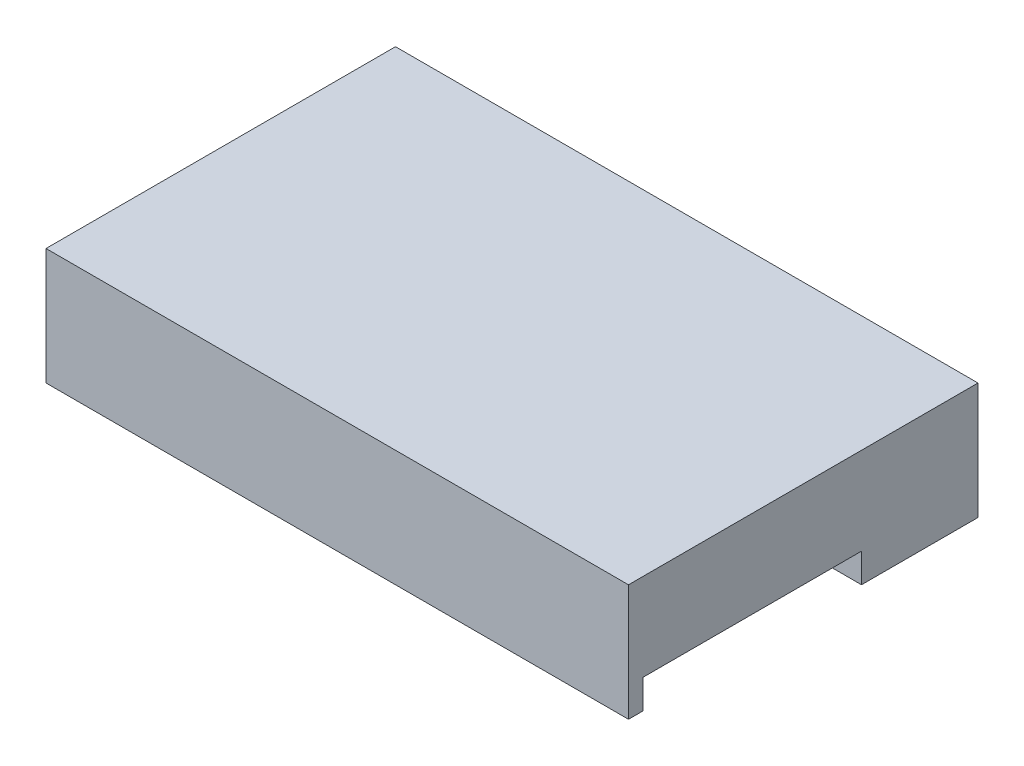
ISO-10303-21;
HEADER;
FILE_DESCRIPTION(('STEP AP214'),'2;1');
FILE_NAME('part.step','',(''),(''),'','','');
FILE_SCHEMA(('AUTOMOTIVE_DESIGN { 1 0 10303 214 1 1 1 1 }'));
ENDSEC;
DATA;
#1=APPLICATION_CONTEXT('core data for automotive mechanical design processes');
#2=APPLICATION_PROTOCOL_DEFINITION('international standard','automotive_design',2000,#1);
#3=PRODUCT_CONTEXT('',#1,'mechanical');
#4=PRODUCT('Part','Part','',(#3));
#5=PRODUCT_RELATED_PRODUCT_CATEGORY('part','',(#4));
#6=PRODUCT_DEFINITION_FORMATION('','',#4);
#7=PRODUCT_DEFINITION_CONTEXT('part definition',#1,'design');
#8=PRODUCT_DEFINITION('design','',#6,#7);
#9=PRODUCT_DEFINITION_SHAPE('','',#8);
#10=(LENGTH_UNIT() NAMED_UNIT(*) SI_UNIT(.MILLI.,.METRE.));
#11=(NAMED_UNIT(*) PLANE_ANGLE_UNIT() SI_UNIT($,.RADIAN.));
#12=(NAMED_UNIT(*) SI_UNIT($,.STERADIAN.) SOLID_ANGLE_UNIT());
#13=UNCERTAINTY_MEASURE_WITH_UNIT(LENGTH_MEASURE(1.E-05),#10,'distance_accuracy_value','');
#14=(GEOMETRIC_REPRESENTATION_CONTEXT(3) GLOBAL_UNCERTAINTY_ASSIGNED_CONTEXT((#13)) GLOBAL_UNIT_ASSIGNED_CONTEXT((#10,
#11,#12)) REPRESENTATION_CONTEXT('',''));
#15=CARTESIAN_POINT('',(0.,0.,0.));
#16=DIRECTION('',(0.,0.,1.));
#17=DIRECTION('',(1.,0.,0.));
#18=AXIS2_PLACEMENT_3D('',#15,#16,#17);
#19=CARTESIAN_POINT('',(0.,1.,0.));
#20=DIRECTION('',(0.,-1.,0.));
#21=DIRECTION('',(0.,0.,-1.));
#22=AXIS2_PLACEMENT_3D('',#19,#20,#21);
#23=PLANE('',#22);
#24=DIRECTION('',(0.,0.,1.));
#25=VECTOR('',#24,1.);
#26=CARTESIAN_POINT('',(10.,1.,6.));
#27=LINE('',#26,#25);
#28=CARTESIAN_POINT('',(10.,1.,-2.));
#29=VERTEX_POINT('',#28);
#30=CARTESIAN_POINT('',(10.,1.,5.5));
#31=VERTEX_POINT('',#30);
#32=EDGE_CURVE('E48',#29,#31,#27,.T.);
#33=ORIENTED_EDGE('',*,*,#32,.T.);
#34=DIRECTION('',(1.,0.,0.));
#35=VECTOR('',#34,1.);
#36=CARTESIAN_POINT('',(-10.,1.,5.5));
#37=LINE('',#36,#35);
#38=CARTESIAN_POINT('',(-10.,1.,5.5));
#39=VERTEX_POINT('',#38);
#40=EDGE_CURVE('E52',#39,#31,#37,.T.);
#41=ORIENTED_EDGE('',*,*,#40,.F.);
#42=DIRECTION('',(0.,0.,-1.));
#43=VECTOR('',#42,1.);
#44=CARTESIAN_POINT('',(-10.,1.,6.));
#45=LINE('',#44,#43);
#46=CARTESIAN_POINT('',(-10.,1.,-2.));
#47=VERTEX_POINT('',#46);
#48=EDGE_CURVE('E121',#39,#47,#45,.T.);
#49=ORIENTED_EDGE('',*,*,#48,.T.);
#50=DIRECTION('',(1.,0.,0.));
#51=VECTOR('',#50,1.);
#52=CARTESIAN_POINT('',(-10.,1.,-2.));
#53=LINE('',#52,#51);
#54=EDGE_CURVE('E129',#47,#29,#53,.T.);
#55=ORIENTED_EDGE('',*,*,#54,.T.);
#56=EDGE_LOOP('',(#33,#41,#49,#55));
#57=FACE_BOUND('',#56,.T.);
#58=ADVANCED_FACE('F33',(#57),#23,.T.);
#59=CARTESIAN_POINT('',(-10.,4.,6.));
#60=DIRECTION('',(0.,0.,-1.));
#61=DIRECTION('',(-1.,0.,0.));
#62=AXIS2_PLACEMENT_3D('',#59,#60,#61);
#63=PLANE('',#62);
#64=DIRECTION('',(0.,-1.,0.));
#65=VECTOR('',#64,1.);
#66=CARTESIAN_POINT('',(-10.,4.,6.));
#67=LINE('',#66,#65);
#68=CARTESIAN_POINT('',(-10.,4.,6.));
#69=VERTEX_POINT('',#68);
#70=CARTESIAN_POINT('',(-10.,0.,6.));
#71=VERTEX_POINT('',#70);
#72=EDGE_CURVE('E154',#69,#71,#67,.T.);
#73=ORIENTED_EDGE('',*,*,#72,.T.);
#74=DIRECTION('',(-1.,0.,0.));
#75=VECTOR('',#74,1.);
#76=CARTESIAN_POINT('',(-10.,0.,6.));
#77=LINE('',#76,#75);
#78=CARTESIAN_POINT('',(10.,0.,6.));
#79=VERTEX_POINT('',#78);
#80=EDGE_CURVE('E114',#79,#71,#77,.T.);
#81=ORIENTED_EDGE('',*,*,#80,.F.);
#82=DIRECTION('',(0.,-1.,0.));
#83=VECTOR('',#82,1.);
#84=CARTESIAN_POINT('',(10.,4.,6.));
#85=LINE('',#84,#83);
#86=CARTESIAN_POINT('',(10.,4.,6.));
#87=VERTEX_POINT('',#86);
#88=EDGE_CURVE('E148',#87,#79,#85,.T.);
#89=ORIENTED_EDGE('',*,*,#88,.F.);
#90=DIRECTION('',(1.,0.,0.));
#91=VECTOR('',#90,1.);
#92=CARTESIAN_POINT('',(-10.,4.,6.));
#93=LINE('',#92,#91);
#94=EDGE_CURVE('E146',#69,#87,#93,.T.);
#95=ORIENTED_EDGE('',*,*,#94,.F.);
#96=EDGE_LOOP('',(#73,#81,#89,#95));
#97=FACE_BOUND('',#96,.T.);
#98=ADVANCED_FACE('F175',(#97),#63,.F.);
#99=CARTESIAN_POINT('',(10.,4.,6.));
#100=DIRECTION('',(-1.,0.,0.));
#101=DIRECTION('',(0.,0.,1.));
#102=AXIS2_PLACEMENT_3D('',#99,#100,#101);
#103=PLANE('',#102);
#104=ORIENTED_EDGE('',*,*,#32,.F.);
#105=DIRECTION('',(0.,-1.,0.));
#106=VECTOR('',#105,1.);
#107=CARTESIAN_POINT('',(10.,1.,-2.));
#108=LINE('',#107,#106);
#109=CARTESIAN_POINT('',(10.,0.,-2.));
#110=VERTEX_POINT('',#109);
#111=EDGE_CURVE('E133',#29,#110,#108,.T.);
#112=ORIENTED_EDGE('',*,*,#111,.T.);
#113=DIRECTION('',(0.,0.,-1.));
#114=VECTOR('',#113,1.);
#115=CARTESIAN_POINT('',(10.,0.,6.));
#116=LINE('',#115,#114);
#117=CARTESIAN_POINT('',(10.,0.,-6.));
#118=VERTEX_POINT('',#117);
#119=EDGE_CURVE('E136',#110,#118,#116,.T.);
#120=ORIENTED_EDGE('',*,*,#119,.T.);
#121=DIRECTION('',(0.,-1.,0.));
#122=VECTOR('',#121,1.);
#123=CARTESIAN_POINT('',(10.,4.,-6.));
#124=LINE('',#123,#122);
#125=CARTESIAN_POINT('',(10.,4.,-6.));
#126=VERTEX_POINT('',#125);
#127=EDGE_CURVE('E11',#126,#118,#124,.T.);
#128=ORIENTED_EDGE('',*,*,#127,.F.);
#129=DIRECTION('',(0.,0.,-1.));
#130=VECTOR('',#129,1.);
#131=CARTESIAN_POINT('',(10.,4.,6.));
#132=LINE('',#131,#130);
#133=EDGE_CURVE('E138',#87,#126,#132,.T.);
#134=ORIENTED_EDGE('',*,*,#133,.F.);
#135=ORIENTED_EDGE('',*,*,#88,.T.);
#136=DIRECTION('',(0.,0.,1.));
#137=VECTOR('',#136,1.);
#138=CARTESIAN_POINT('',(10.,0.,6.));
#139=LINE('',#138,#137);
#140=CARTESIAN_POINT('',(10.,0.,5.5));
#141=VERTEX_POINT('',#140);
#142=EDGE_CURVE('E107',#141,#79,#139,.T.);
#143=ORIENTED_EDGE('',*,*,#142,.F.);
#144=DIRECTION('',(0.,1.,0.));
#145=VECTOR('',#144,1.);
#146=CARTESIAN_POINT('',(10.,0.,5.5));
#147=LINE('',#146,#145);
#148=EDGE_CURVE('E103',#141,#31,#147,.T.);
#149=ORIENTED_EDGE('',*,*,#148,.T.);
#150=EDGE_LOOP('',(#104,#112,#120,#128,#134,#135,#143,#149));
#151=FACE_BOUND('',#150,.T.);
#152=ADVANCED_FACE('F35',(#151),#103,.F.);
#153=CARTESIAN_POINT('',(-10.,4.,-6.));
#154=DIRECTION('',(0.,0.,1.));
#155=DIRECTION('',(1.,0.,0.));
#156=AXIS2_PLACEMENT_3D('',#153,#154,#155);
#157=PLANE('',#156);
#158=DIRECTION('',(-1.,0.,0.));
#159=VECTOR('',#158,1.);
#160=CARTESIAN_POINT('',(-10.,0.,-6.));
#161=LINE('',#160,#159);
#162=CARTESIAN_POINT('',(-10.,0.,-6.));
#163=VERTEX_POINT('',#162);
#164=EDGE_CURVE('E150',#118,#163,#161,.T.);
#165=ORIENTED_EDGE('',*,*,#164,.T.);
#166=DIRECTION('',(0.,-1.,0.));
#167=VECTOR('',#166,1.);
#168=CARTESIAN_POINT('',(-10.,4.,-6.));
#169=LINE('',#168,#167);
#170=CARTESIAN_POINT('',(-10.,4.,-6.));
#171=VERTEX_POINT('',#170);
#172=EDGE_CURVE('E41',#171,#163,#169,.T.);
#173=ORIENTED_EDGE('',*,*,#172,.F.);
#174=DIRECTION('',(-1.,0.,0.));
#175=VECTOR('',#174,1.);
#176=CARTESIAN_POINT('',(-10.,4.,-6.));
#177=LINE('',#176,#175);
#178=EDGE_CURVE('E141',#126,#171,#177,.T.);
#179=ORIENTED_EDGE('',*,*,#178,.F.);
#180=ORIENTED_EDGE('',*,*,#127,.T.);
#181=EDGE_LOOP('',(#165,#173,#179,#180));
#182=FACE_BOUND('',#181,.T.);
#183=ADVANCED_FACE('F179',(#182),#157,.F.);
#184=CARTESIAN_POINT('',(-10.,4.,6.));
#185=DIRECTION('',(1.,0.,0.));
#186=DIRECTION('',(0.,0.,-1.));
#187=AXIS2_PLACEMENT_3D('',#184,#185,#186);
#188=PLANE('',#187);
#189=DIRECTION('',(0.,0.,1.));
#190=VECTOR('',#189,1.);
#191=CARTESIAN_POINT('',(-10.,0.,6.));
#192=LINE('',#191,#190);
#193=CARTESIAN_POINT('',(-10.,0.,-2.));
#194=VERTEX_POINT('',#193);
#195=EDGE_CURVE('E142',#163,#194,#192,.T.);
#196=ORIENTED_EDGE('',*,*,#195,.T.);
#197=DIRECTION('',(0.,-1.,0.));
#198=VECTOR('',#197,1.);
#199=CARTESIAN_POINT('',(-10.,1.,-2.));
#200=LINE('',#199,#198);
#201=EDGE_CURVE('E131',#47,#194,#200,.T.);
#202=ORIENTED_EDGE('',*,*,#201,.F.);
#203=ORIENTED_EDGE('',*,*,#48,.F.);
#204=DIRECTION('',(0.,1.,0.));
#205=VECTOR('',#204,1.);
#206=CARTESIAN_POINT('',(-10.,0.,5.5));
#207=LINE('',#206,#205);
#208=CARTESIAN_POINT('',(-10.,0.,5.5));
#209=VERTEX_POINT('',#208);
#210=EDGE_CURVE('E101',#209,#39,#207,.T.);
#211=ORIENTED_EDGE('',*,*,#210,.F.);
#212=DIRECTION('',(0.,0.,-1.));
#213=VECTOR('',#212,1.);
#214=CARTESIAN_POINT('',(-10.,0.,6.));
#215=LINE('',#214,#213);
#216=EDGE_CURVE('E108',#71,#209,#215,.T.);
#217=ORIENTED_EDGE('',*,*,#216,.F.);
#218=ORIENTED_EDGE('',*,*,#72,.F.);
#219=DIRECTION('',(0.,0.,1.));
#220=VECTOR('',#219,1.);
#221=CARTESIAN_POINT('',(-10.,4.,6.));
#222=LINE('',#221,#220);
#223=EDGE_CURVE('E144',#171,#69,#222,.T.);
#224=ORIENTED_EDGE('',*,*,#223,.F.);
#225=ORIENTED_EDGE('',*,*,#172,.T.);
#226=EDGE_LOOP('',(#196,#202,#203,#211,#217,#218,#224,#225));
#227=FACE_BOUND('',#226,.T.);
#228=ADVANCED_FACE('F119',(#227),#188,.F.);
#229=CARTESIAN_POINT('',(0.,4.,0.));
#230=DIRECTION('',(0.,-1.,0.));
#231=DIRECTION('',(0.,0.,-1.));
#232=AXIS2_PLACEMENT_3D('',#229,#230,#231);
#233=PLANE('',#232);
#234=ORIENTED_EDGE('',*,*,#133,.T.);
#235=ORIENTED_EDGE('',*,*,#178,.T.);
#236=ORIENTED_EDGE('',*,*,#223,.T.);
#237=ORIENTED_EDGE('',*,*,#94,.T.);
#238=EDGE_LOOP('',(#234,#235,#236,#237));
#239=FACE_BOUND('',#238,.T.);
#240=ADVANCED_FACE('F178',(#239),#233,.F.);
#241=CARTESIAN_POINT('',(0.,0.,0.));
#242=DIRECTION('',(0.,-1.,0.));
#243=DIRECTION('',(0.,0.,-1.));
#244=AXIS2_PLACEMENT_3D('',#241,#242,#243);
#245=PLANE('',#244);
#246=DIRECTION('',(1.,0.,0.));
#247=VECTOR('',#246,1.);
#248=CARTESIAN_POINT('',(-10.,0.,-2.));
#249=LINE('',#248,#247);
#250=EDGE_CURVE('E122',#194,#110,#249,.T.);
#251=ORIENTED_EDGE('',*,*,#250,.F.);
#252=ORIENTED_EDGE('',*,*,#195,.F.);
#253=ORIENTED_EDGE('',*,*,#164,.F.);
#254=ORIENTED_EDGE('',*,*,#119,.F.);
#255=EDGE_LOOP('',(#251,#252,#253,#254));
#256=FACE_BOUND('',#255,.T.);
#257=ADVANCED_FACE('F163',(#256),#245,.T.);
#258=CARTESIAN_POINT('',(-10.,1.,-2.));
#259=DIRECTION('',(0.,0.,-1.));
#260=DIRECTION('',(-1.,0.,0.));
#261=AXIS2_PLACEMENT_3D('',#258,#259,#260);
#262=PLANE('',#261);
#263=ORIENTED_EDGE('',*,*,#250,.T.);
#264=ORIENTED_EDGE('',*,*,#111,.F.);
#265=ORIENTED_EDGE('',*,*,#54,.F.);
#266=ORIENTED_EDGE('',*,*,#201,.T.);
#267=EDGE_LOOP('',(#263,#264,#265,#266));
#268=FACE_BOUND('',#267,.T.);
#269=ADVANCED_FACE('F166',(#268),#262,.F.);
#270=CARTESIAN_POINT('',(-10.,0.,5.5));
#271=DIRECTION('',(0.,0.,1.));
#272=DIRECTION('',(1.,0.,0.));
#273=AXIS2_PLACEMENT_3D('',#270,#271,#272);
#274=PLANE('',#273);
#275=ORIENTED_EDGE('',*,*,#40,.T.);
#276=ORIENTED_EDGE('',*,*,#148,.F.);
#277=DIRECTION('',(1.,0.,0.));
#278=VECTOR('',#277,1.);
#279=CARTESIAN_POINT('',(-10.,0.,5.5));
#280=LINE('',#279,#278);
#281=EDGE_CURVE('E97',#209,#141,#280,.T.);
#282=ORIENTED_EDGE('',*,*,#281,.F.);
#283=ORIENTED_EDGE('',*,*,#210,.T.);
#284=EDGE_LOOP('',(#275,#276,#282,#283));
#285=FACE_BOUND('',#284,.T.);
#286=ADVANCED_FACE('F99',(#285),#274,.F.);
#287=CARTESIAN_POINT('',(0.,0.,0.));
#288=DIRECTION('',(0.,-1.,0.));
#289=DIRECTION('',(0.,0.,-1.));
#290=AXIS2_PLACEMENT_3D('',#287,#288,#289);
#291=PLANE('',#290);
#292=ORIENTED_EDGE('',*,*,#216,.T.);
#293=ORIENTED_EDGE('',*,*,#281,.T.);
#294=ORIENTED_EDGE('',*,*,#142,.T.);
#295=ORIENTED_EDGE('',*,*,#80,.T.);
#296=EDGE_LOOP('',(#292,#293,#294,#295));
#297=FACE_BOUND('',#296,.T.);
#298=ADVANCED_FACE('F112',(#297),#291,.T.);
#299=CLOSED_SHELL('',(#58,#98,#152,#183,#228,#240,#257,#269,#286,#298));
#300=MANIFOLD_SOLID_BREP('B2',#299);
#301=ADVANCED_BREP_SHAPE_REPRESENTATION('',(#18,#300),#14);
#302=SHAPE_DEFINITION_REPRESENTATION(#9,#301);
ENDSEC;
END-ISO-10303-21;
